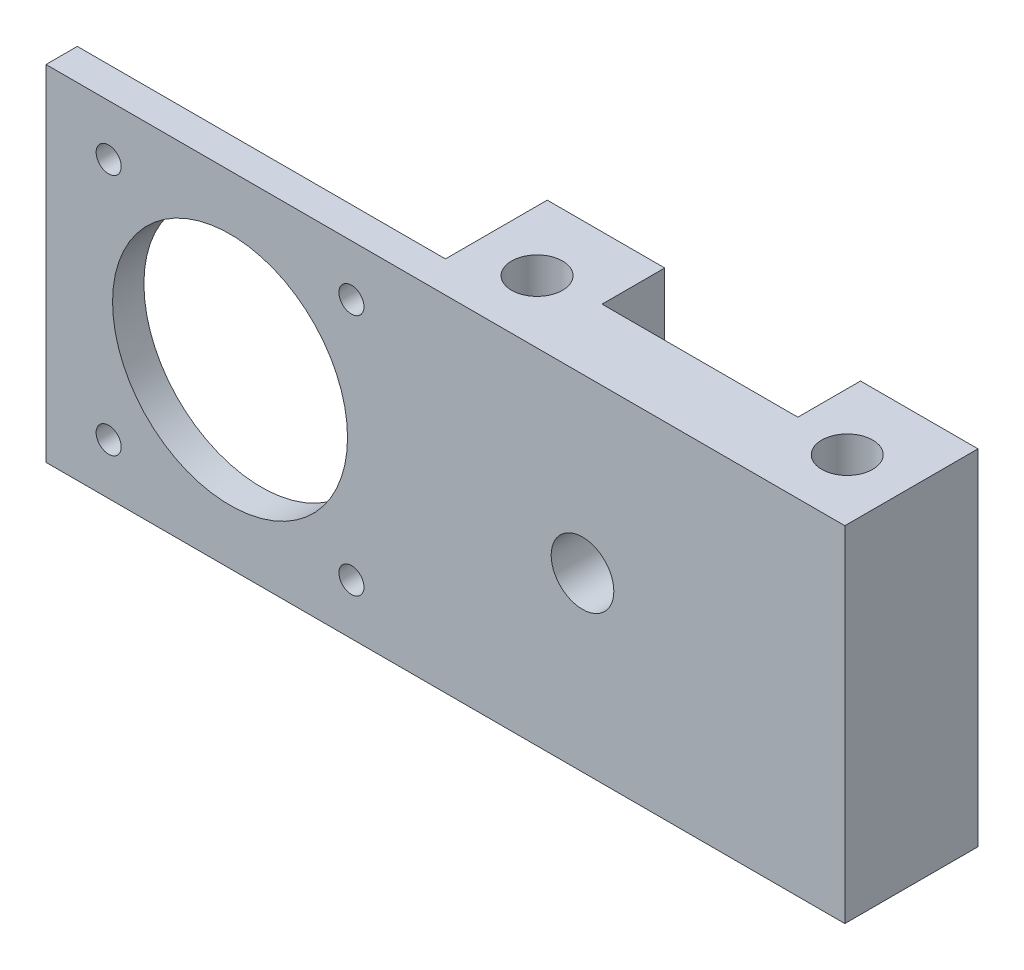
ISO-10303-21;
HEADER;
FILE_DESCRIPTION(('STEP AP214'),'2;1');
FILE_NAME('part.step','',(''),(''),'','','');
FILE_SCHEMA(('AUTOMOTIVE_DESIGN { 1 0 10303 214 1 1 1 1 }'));
ENDSEC;
DATA;
#1=APPLICATION_CONTEXT('core data for automotive mechanical design processes');
#2=APPLICATION_PROTOCOL_DEFINITION('international standard','automotive_design',2000,#1);
#3=PRODUCT_CONTEXT('',#1,'mechanical');
#4=PRODUCT('Part','Part','',(#3));
#5=PRODUCT_RELATED_PRODUCT_CATEGORY('part','',(#4));
#6=PRODUCT_DEFINITION_FORMATION('','',#4);
#7=PRODUCT_DEFINITION_CONTEXT('part definition',#1,'design');
#8=PRODUCT_DEFINITION('design','',#6,#7);
#9=PRODUCT_DEFINITION_SHAPE('','',#8);
#10=(LENGTH_UNIT() NAMED_UNIT(*) SI_UNIT(.MILLI.,.METRE.));
#11=(NAMED_UNIT(*) PLANE_ANGLE_UNIT() SI_UNIT($,.RADIAN.));
#12=(NAMED_UNIT(*) SI_UNIT($,.STERADIAN.) SOLID_ANGLE_UNIT());
#13=UNCERTAINTY_MEASURE_WITH_UNIT(LENGTH_MEASURE(1.E-05),#10,'distance_accuracy_value','');
#14=(GEOMETRIC_REPRESENTATION_CONTEXT(3) GLOBAL_UNCERTAINTY_ASSIGNED_CONTEXT((#13)) GLOBAL_UNIT_ASSIGNED_CONTEXT((#10,
#11,#12)) REPRESENTATION_CONTEXT('',''));
#15=CARTESIAN_POINT('',(0.,0.,0.));
#16=DIRECTION('',(0.,0.,1.));
#17=DIRECTION('',(1.,0.,0.));
#18=AXIS2_PLACEMENT_3D('',#15,#16,#17);
#19=CARTESIAN_POINT('',(0.,0.,0.));
#20=DIRECTION('',(0.,0.,-1.));
#21=DIRECTION('',(-1.,0.,0.));
#22=AXIS2_PLACEMENT_3D('',#19,#20,#21);
#23=PLANE('',#22);
#24=DIRECTION('',(0.,-1.,0.));
#25=VECTOR('',#24,1.);
#26=CARTESIAN_POINT('',(12.5,25.,0.));
#27=LINE('',#26,#25);
#28=CARTESIAN_POINT('',(12.5,22.,0.));
#29=VERTEX_POINT('',#28);
#30=CARTESIAN_POINT('',(12.5,-22.,0.));
#31=VERTEX_POINT('',#30);
#32=EDGE_CURVE('E136',#29,#31,#27,.T.);
#33=ORIENTED_EDGE('',*,*,#32,.F.);
#34=DIRECTION('',(-1.,0.,0.));
#35=VECTOR('',#34,1.);
#36=CARTESIAN_POINT('',(-27.5,22.,0.));
#37=LINE('',#36,#35);
#38=CARTESIAN_POINT('',(27.5,22.,0.));
#39=VERTEX_POINT('',#38);
#40=EDGE_CURVE('E188',#39,#29,#37,.T.);
#41=ORIENTED_EDGE('',*,*,#40,.F.);
#42=DIRECTION('',(0.,1.,0.));
#43=VECTOR('',#42,1.);
#44=CARTESIAN_POINT('',(27.5,-22.,0.));
#45=LINE('',#44,#43);
#46=CARTESIAN_POINT('',(27.5,-22.,0.));
#47=VERTEX_POINT('',#46);
#48=EDGE_CURVE('E184',#47,#39,#45,.T.);
#49=ORIENTED_EDGE('',*,*,#48,.F.);
#50=DIRECTION('',(1.,0.,0.));
#51=VECTOR('',#50,1.);
#52=CARTESIAN_POINT('',(-27.5,-22.,0.));
#53=LINE('',#52,#51);
#54=EDGE_CURVE('E194',#31,#47,#53,.T.);
#55=ORIENTED_EDGE('',*,*,#54,.F.);
#56=EDGE_LOOP('',(#33,#41,#49,#55));
#57=FACE_BOUND('',#56,.T.);
#58=ADVANCED_FACE('F37',(#57),#23,.T.);
#59=CARTESIAN_POINT('',(27.5,-22.,18.));
#60=DIRECTION('',(-1.,0.,0.));
#61=DIRECTION('',(0.,0.,1.));
#62=AXIS2_PLACEMENT_3D('',#59,#60,#61);
#63=PLANE('',#62);
#64=DIRECTION('',(0.,0.,-1.));
#65=VECTOR('',#64,1.);
#66=CARTESIAN_POINT('',(27.5,22.,18.));
#67=LINE('',#66,#65);
#68=CARTESIAN_POINT('',(27.5,22.,17.));
#69=VERTEX_POINT('',#68);
#70=EDGE_CURVE('E11',#69,#39,#67,.T.);
#71=ORIENTED_EDGE('',*,*,#70,.F.);
#72=DIRECTION('',(0.,-1.,0.));
#73=VECTOR('',#72,1.);
#74=CARTESIAN_POINT('',(27.5,-22.,17.));
#75=LINE('',#74,#73);
#76=CARTESIAN_POINT('',(27.5,-22.,17.));
#77=VERTEX_POINT('',#76);
#78=EDGE_CURVE('E234',#69,#77,#75,.T.);
#79=ORIENTED_EDGE('',*,*,#78,.T.);
#80=DIRECTION('',(0.,0.,-1.));
#81=VECTOR('',#80,1.);
#82=CARTESIAN_POINT('',(27.5,-22.,18.));
#83=LINE('',#82,#81);
#84=EDGE_CURVE('E131',#77,#47,#83,.T.);
#85=ORIENTED_EDGE('',*,*,#84,.T.);
#86=ORIENTED_EDGE('',*,*,#48,.T.);
#87=EDGE_LOOP('',(#71,#79,#85,#86));
#88=FACE_BOUND('',#87,.T.);
#89=ADVANCED_FACE('F39',(#88),#63,.F.);
#90=CARTESIAN_POINT('',(-27.5,22.,18.));
#91=DIRECTION('',(0.,-1.,0.));
#92=DIRECTION('',(0.,0.,-1.));
#93=AXIS2_PLACEMENT_3D('',#90,#91,#92);
#94=PLANE('',#93);
#95=DIRECTION('',(0.,0.,1.));
#96=VECTOR('',#95,1.);
#97=CARTESIAN_POINT('',(-74.5,22.,13.));
#98=LINE('',#97,#96);
#99=CARTESIAN_POINT('',(-74.5,22.,13.));
#100=VERTEX_POINT('',#99);
#101=CARTESIAN_POINT('',(-74.5,22.,17.));
#102=VERTEX_POINT('',#101);
#103=EDGE_CURVE('E137',#100,#102,#98,.T.);
#104=ORIENTED_EDGE('',*,*,#103,.T.);
#105=DIRECTION('',(1.,0.,0.));
#106=VECTOR('',#105,1.);
#107=CARTESIAN_POINT('',(-27.5,22.,17.));
#108=LINE('',#107,#106);
#109=EDGE_CURVE('E54',#102,#69,#108,.T.);
#110=ORIENTED_EDGE('',*,*,#109,.T.);
#111=ORIENTED_EDGE('',*,*,#70,.T.);
#112=ORIENTED_EDGE('',*,*,#40,.T.);
#113=DIRECTION('',(0.,0.,1.));
#114=VECTOR('',#113,1.);
#115=CARTESIAN_POINT('',(12.5,22.,18.));
#116=LINE('',#115,#114);
#117=CARTESIAN_POINT('',(12.5,22.,8.));
#118=VERTEX_POINT('',#117);
#119=EDGE_CURVE('E169',#29,#118,#116,.T.);
#120=ORIENTED_EDGE('',*,*,#119,.T.);
#121=DIRECTION('',(-1.,0.,0.));
#122=VECTOR('',#121,1.);
#123=CARTESIAN_POINT('',(-27.5,22.,8.));
#124=LINE('',#123,#122);
#125=CARTESIAN_POINT('',(-12.5,22.,8.));
#126=VERTEX_POINT('',#125);
#127=EDGE_CURVE('E157',#118,#126,#124,.T.);
#128=ORIENTED_EDGE('',*,*,#127,.T.);
#129=DIRECTION('',(0.,0.,-1.));
#130=VECTOR('',#129,1.);
#131=CARTESIAN_POINT('',(-12.5,22.,18.));
#132=LINE('',#131,#130);
#133=CARTESIAN_POINT('',(-12.5,22.,0.));
#134=VERTEX_POINT('',#133);
#135=EDGE_CURVE('E163',#126,#134,#132,.T.);
#136=ORIENTED_EDGE('',*,*,#135,.T.);
#137=CARTESIAN_POINT('',(-27.5,22.,0.));
#138=VERTEX_POINT('',#137);
#139=EDGE_CURVE('E187',#134,#138,#37,.T.);
#140=ORIENTED_EDGE('',*,*,#139,.T.);
#141=DIRECTION('',(0.,0.,-1.));
#142=VECTOR('',#141,1.);
#143=CARTESIAN_POINT('',(-27.5,22.,18.));
#144=LINE('',#143,#142);
#145=CARTESIAN_POINT('',(-27.5,22.,13.));
#146=VERTEX_POINT('',#145);
#147=EDGE_CURVE('E46',#146,#138,#144,.T.);
#148=ORIENTED_EDGE('',*,*,#147,.F.);
#149=DIRECTION('',(-1.,0.,0.));
#150=VECTOR('',#149,1.);
#151=CARTESIAN_POINT('',(-74.5,22.,13.));
#152=LINE('',#151,#150);
#153=EDGE_CURVE('E62',#146,#100,#152,.T.);
#154=ORIENTED_EDGE('',*,*,#153,.T.);
#155=EDGE_LOOP('',(#104,#110,#111,#112,#120,#128,#136,#140,#148,#154));
#156=FACE_BOUND('',#155,.T.);
#157=CARTESIAN_POINT('',(19.8,22.,9.));
#158=DIRECTION('',(0.,1.,0.));
#159=DIRECTION('',(0.,0.,1.));
#160=AXIS2_PLACEMENT_3D('',#157,#158,#159);
#161=CIRCLE('',#160,3.25);
#162=CARTESIAN_POINT('',(19.8,22.,12.25));
#163=VERTEX_POINT('',#162);
#164=EDGE_CURVE('E172',#163,#163,#161,.T.);
#165=ORIENTED_EDGE('',*,*,#164,.F.);
#166=EDGE_LOOP('',(#165));
#167=FACE_BOUND('',#166,.T.);
#168=CARTESIAN_POINT('',(-19.8,22.,9.));
#169=DIRECTION('',(0.,1.,0.));
#170=DIRECTION('',(0.,0.,1.));
#171=AXIS2_PLACEMENT_3D('',#168,#169,#170);
#172=CIRCLE('',#171,3.25);
#173=CARTESIAN_POINT('',(-19.8,22.,12.25));
#174=VERTEX_POINT('',#173);
#175=EDGE_CURVE('E178',#174,#174,#172,.T.);
#176=ORIENTED_EDGE('',*,*,#175,.F.);
#177=EDGE_LOOP('',(#176));
#178=FACE_BOUND('',#177,.T.);
#179=ADVANCED_FACE('F225',(#156,#167,#178),#94,.F.);
#180=CARTESIAN_POINT('',(-27.5,-22.,18.));
#181=DIRECTION('',(1.,0.,0.));
#182=DIRECTION('',(0.,0.,-1.));
#183=AXIS2_PLACEMENT_3D('',#180,#181,#182);
#184=PLANE('',#183);
#185=DIRECTION('',(0.,0.,-1.));
#186=VECTOR('',#185,1.);
#187=CARTESIAN_POINT('',(-27.5,-22.,18.));
#188=LINE('',#187,#186);
#189=CARTESIAN_POINT('',(-27.5,-22.,13.));
#190=VERTEX_POINT('',#189);
#191=CARTESIAN_POINT('',(-27.5,-22.,0.));
#192=VERTEX_POINT('',#191);
#193=EDGE_CURVE('E199',#190,#192,#188,.T.);
#194=ORIENTED_EDGE('',*,*,#193,.F.);
#195=DIRECTION('',(0.,1.,0.));
#196=VECTOR('',#195,1.);
#197=CARTESIAN_POINT('',(-27.5,-22.,13.));
#198=LINE('',#197,#196);
#199=EDGE_CURVE('E256',#190,#146,#198,.T.);
#200=ORIENTED_EDGE('',*,*,#199,.T.);
#201=ORIENTED_EDGE('',*,*,#147,.T.);
#202=DIRECTION('',(0.,-1.,0.));
#203=VECTOR('',#202,1.);
#204=CARTESIAN_POINT('',(-27.5,-22.,0.));
#205=LINE('',#204,#203);
#206=EDGE_CURVE('E191',#138,#192,#205,.T.);
#207=ORIENTED_EDGE('',*,*,#206,.T.);
#208=EDGE_LOOP('',(#194,#200,#201,#207));
#209=FACE_BOUND('',#208,.T.);
#210=ADVANCED_FACE('F260',(#209),#184,.F.);
#211=CARTESIAN_POINT('',(-27.5,-22.,18.));
#212=DIRECTION('',(0.,1.,0.));
#213=DIRECTION('',(0.,0.,1.));
#214=AXIS2_PLACEMENT_3D('',#211,#212,#213);
#215=PLANE('',#214);
#216=CARTESIAN_POINT('',(19.8,-22.,9.));
#217=DIRECTION('',(0.,1.,0.));
#218=DIRECTION('',(0.,0.,1.));
#219=AXIS2_PLACEMENT_3D('',#216,#217,#218);
#220=CIRCLE('',#219,3.24999999999999);
#221=CARTESIAN_POINT('',(19.8,-22.,12.25));
#222=VERTEX_POINT('',#221);
#223=EDGE_CURVE('E175',#222,#222,#220,.T.);
#224=ORIENTED_EDGE('',*,*,#223,.T.);
#225=EDGE_LOOP('',(#224));
#226=FACE_BOUND('',#225,.T.);
#227=CARTESIAN_POINT('',(-19.8,-22.,9.));
#228=DIRECTION('',(0.,1.,0.));
#229=DIRECTION('',(0.,0.,1.));
#230=AXIS2_PLACEMENT_3D('',#227,#228,#229);
#231=CIRCLE('',#230,3.24999999999999);
#232=CARTESIAN_POINT('',(-19.8,-22.,12.25));
#233=VERTEX_POINT('',#232);
#234=EDGE_CURVE('E181',#233,#233,#231,.T.);
#235=ORIENTED_EDGE('',*,*,#234,.T.);
#236=EDGE_LOOP('',(#235));
#237=FACE_BOUND('',#236,.T.);
#238=ORIENTED_EDGE('',*,*,#84,.F.);
#239=DIRECTION('',(-1.,0.,0.));
#240=VECTOR('',#239,1.);
#241=CARTESIAN_POINT('',(-27.5,-22.,17.));
#242=LINE('',#241,#240);
#243=CARTESIAN_POINT('',(-74.5,-22.,17.));
#244=VERTEX_POINT('',#243);
#245=EDGE_CURVE('E117',#77,#244,#242,.T.);
#246=ORIENTED_EDGE('',*,*,#245,.T.);
#247=DIRECTION('',(0.,0.,1.));
#248=VECTOR('',#247,1.);
#249=CARTESIAN_POINT('',(-74.5,-22.,13.));
#250=LINE('',#249,#248);
#251=CARTESIAN_POINT('',(-74.5,-22.,13.));
#252=VERTEX_POINT('',#251);
#253=EDGE_CURVE('E128',#252,#244,#250,.T.);
#254=ORIENTED_EDGE('',*,*,#253,.F.);
#255=DIRECTION('',(1.,0.,0.));
#256=VECTOR('',#255,1.);
#257=CARTESIAN_POINT('',(-74.5,-22.,13.));
#258=LINE('',#257,#256);
#259=EDGE_CURVE('E141',#252,#190,#258,.T.);
#260=ORIENTED_EDGE('',*,*,#259,.T.);
#261=ORIENTED_EDGE('',*,*,#193,.T.);
#262=CARTESIAN_POINT('',(-12.5,-22.,0.));
#263=VERTEX_POINT('',#262);
#264=EDGE_CURVE('E195',#192,#263,#53,.T.);
#265=ORIENTED_EDGE('',*,*,#264,.T.);
#266=DIRECTION('',(0.,0.,1.));
#267=VECTOR('',#266,1.);
#268=CARTESIAN_POINT('',(-12.5,-22.,18.));
#269=LINE('',#268,#267);
#270=CARTESIAN_POINT('',(-12.5,-22.,8.));
#271=VERTEX_POINT('',#270);
#272=EDGE_CURVE('E160',#263,#271,#269,.T.);
#273=ORIENTED_EDGE('',*,*,#272,.T.);
#274=DIRECTION('',(1.,0.,0.));
#275=VECTOR('',#274,1.);
#276=CARTESIAN_POINT('',(-27.5,-22.,8.));
#277=LINE('',#276,#275);
#278=CARTESIAN_POINT('',(12.5,-22.,8.));
#279=VERTEX_POINT('',#278);
#280=EDGE_CURVE('E154',#271,#279,#277,.T.);
#281=ORIENTED_EDGE('',*,*,#280,.T.);
#282=DIRECTION('',(0.,0.,-1.));
#283=VECTOR('',#282,1.);
#284=CARTESIAN_POINT('',(12.5,-22.,18.));
#285=LINE('',#284,#283);
#286=EDGE_CURVE('E166',#279,#31,#285,.T.);
#287=ORIENTED_EDGE('',*,*,#286,.T.);
#288=ORIENTED_EDGE('',*,*,#54,.T.);
#289=EDGE_LOOP('',(#238,#246,#254,#260,#261,#265,#273,#281,#287,#288));
#290=FACE_BOUND('',#289,.T.);
#291=ADVANCED_FACE('F126',(#226,#237,#290),#215,.F.);
#292=DIRECTION('',(0.,1.,0.));
#293=VECTOR('',#292,1.);
#294=CARTESIAN_POINT('',(-12.5,25.,0.));
#295=LINE('',#294,#293);
#296=EDGE_CURVE('E139',#263,#134,#295,.T.);
#297=ORIENTED_EDGE('',*,*,#296,.F.);
#298=ORIENTED_EDGE('',*,*,#264,.F.);
#299=ORIENTED_EDGE('',*,*,#206,.F.);
#300=ORIENTED_EDGE('',*,*,#139,.F.);
#301=EDGE_LOOP('',(#297,#298,#299,#300));
#302=FACE_BOUND('',#301,.T.);
#303=ADVANCED_FACE('F220',(#302),#23,.T.);
#304=CARTESIAN_POINT('',(-6.,0.,0.));
#305=DIRECTION('',(0.,0.,1.));
#306=DIRECTION('',(1.,0.,0.));
#307=AXIS2_PLACEMENT_3D('',#304,#305,#306);
#308=CYLINDRICAL_SURFACE('',#307,4.);
#309=CARTESIAN_POINT('',(-6.,0.,17.));
#310=DIRECTION('',(0.,0.,-1.));
#311=DIRECTION('',(-1.,0.,0.));
#312=AXIS2_PLACEMENT_3D('',#309,#310,#311);
#313=CIRCLE('',#312,4.);
#314=CARTESIAN_POINT('',(-10.,0.,17.));
#315=VERTEX_POINT('',#314);
#316=EDGE_CURVE('E235',#315,#315,#313,.F.);
#317=ORIENTED_EDGE('',*,*,#316,.T.);
#318=EDGE_LOOP('',(#317));
#319=FACE_BOUND('',#318,.T.);
#320=CARTESIAN_POINT('',(-6.,0.,8.));
#321=DIRECTION('',(0.,0.,1.));
#322=DIRECTION('',(1.,0.,0.));
#323=AXIS2_PLACEMENT_3D('',#320,#321,#322);
#324=CIRCLE('',#323,4.);
#325=CARTESIAN_POINT('',(-2.,0.,8.));
#326=VERTEX_POINT('',#325);
#327=EDGE_CURVE('E151',#326,#326,#324,.F.);
#328=ORIENTED_EDGE('',*,*,#327,.T.);
#329=EDGE_LOOP('',(#328));
#330=FACE_BOUND('',#329,.T.);
#331=ADVANCED_FACE('F204',(#319,#330),#308,.F.);
#332=CARTESIAN_POINT('',(-19.8,22.,9.));
#333=DIRECTION('',(0.,1.,0.));
#334=DIRECTION('',(0.,0.,1.));
#335=AXIS2_PLACEMENT_3D('',#332,#333,#334);
#336=CYLINDRICAL_SURFACE('',#335,3.25);
#337=ORIENTED_EDGE('',*,*,#234,.F.);
#338=EDGE_LOOP('',(#337));
#339=FACE_BOUND('',#338,.T.);
#340=ORIENTED_EDGE('',*,*,#175,.T.);
#341=EDGE_LOOP('',(#340));
#342=FACE_BOUND('',#341,.T.);
#343=ADVANCED_FACE('F292',(#339,#342),#336,.F.);
#344=CARTESIAN_POINT('',(19.8,22.,9.));
#345=DIRECTION('',(0.,1.,0.));
#346=DIRECTION('',(0.,0.,1.));
#347=AXIS2_PLACEMENT_3D('',#344,#345,#346);
#348=CYLINDRICAL_SURFACE('',#347,3.25);
#349=ORIENTED_EDGE('',*,*,#223,.F.);
#350=EDGE_LOOP('',(#349));
#351=FACE_BOUND('',#350,.T.);
#352=ORIENTED_EDGE('',*,*,#164,.T.);
#353=EDGE_LOOP('',(#352));
#354=FACE_BOUND('',#353,.T.);
#355=ADVANCED_FACE('F340',(#351,#354),#348,.F.);
#356=CARTESIAN_POINT('',(12.5,25.,8.));
#357=DIRECTION('',(1.,0.,0.));
#358=DIRECTION('',(0.,1.,0.));
#359=AXIS2_PLACEMENT_3D('',#356,#357,#358);
#360=PLANE('',#359);
#361=ORIENTED_EDGE('',*,*,#32,.T.);
#362=ORIENTED_EDGE('',*,*,#286,.F.);
#363=DIRECTION('',(0.,-1.,0.));
#364=VECTOR('',#363,1.);
#365=CARTESIAN_POINT('',(12.5,25.,8.));
#366=LINE('',#365,#364);
#367=EDGE_CURVE('E146',#118,#279,#366,.T.);
#368=ORIENTED_EDGE('',*,*,#367,.F.);
#369=ORIENTED_EDGE('',*,*,#119,.F.);
#370=EDGE_LOOP('',(#361,#362,#368,#369));
#371=FACE_BOUND('',#370,.T.);
#372=ADVANCED_FACE('F229',(#371),#360,.F.);
#373=CARTESIAN_POINT('',(-12.5,25.,8.));
#374=DIRECTION('',(-1.,0.,0.));
#375=DIRECTION('',(0.,-1.,0.));
#376=AXIS2_PLACEMENT_3D('',#373,#374,#375);
#377=PLANE('',#376);
#378=DIRECTION('',(0.,1.,0.));
#379=VECTOR('',#378,1.);
#380=CARTESIAN_POINT('',(-12.5,25.,8.));
#381=LINE('',#380,#379);
#382=EDGE_CURVE('E149',#271,#126,#381,.T.);
#383=ORIENTED_EDGE('',*,*,#382,.F.);
#384=ORIENTED_EDGE('',*,*,#272,.F.);
#385=ORIENTED_EDGE('',*,*,#296,.T.);
#386=ORIENTED_EDGE('',*,*,#135,.F.);
#387=EDGE_LOOP('',(#383,#384,#385,#386));
#388=FACE_BOUND('',#387,.T.);
#389=ADVANCED_FACE('F209',(#388),#377,.F.);
#390=CARTESIAN_POINT('',(0.,0.,8.));
#391=DIRECTION('',(0.,0.,1.));
#392=DIRECTION('',(1.,0.,0.));
#393=AXIS2_PLACEMENT_3D('',#390,#391,#392);
#394=PLANE('',#393);
#395=ORIENTED_EDGE('',*,*,#327,.F.);
#396=EDGE_LOOP('',(#395));
#397=FACE_BOUND('',#396,.T.);
#398=ORIENTED_EDGE('',*,*,#367,.T.);
#399=ORIENTED_EDGE('',*,*,#280,.F.);
#400=ORIENTED_EDGE('',*,*,#382,.T.);
#401=ORIENTED_EDGE('',*,*,#127,.F.);
#402=EDGE_LOOP('',(#398,#399,#400,#401));
#403=FACE_BOUND('',#402,.T.);
#404=ADVANCED_FACE('F206',(#397,#403),#394,.F.);
#405=CARTESIAN_POINT('',(-74.5,-22.,13.));
#406=DIRECTION('',(-1.,0.,0.));
#407=DIRECTION('',(0.,0.,1.));
#408=AXIS2_PLACEMENT_3D('',#405,#406,#407);
#409=PLANE('',#408);
#410=DIRECTION('',(0.,-1.,0.));
#411=VECTOR('',#410,1.);
#412=CARTESIAN_POINT('',(-74.5,-22.,17.));
#413=LINE('',#412,#411);
#414=EDGE_CURVE('E113',#102,#244,#413,.T.);
#415=ORIENTED_EDGE('',*,*,#414,.F.);
#416=ORIENTED_EDGE('',*,*,#103,.F.);
#417=DIRECTION('',(0.,-1.,0.));
#418=VECTOR('',#417,1.);
#419=CARTESIAN_POINT('',(-74.5,-22.,13.));
#420=LINE('',#419,#418);
#421=EDGE_CURVE('E134',#100,#252,#420,.T.);
#422=ORIENTED_EDGE('',*,*,#421,.T.);
#423=ORIENTED_EDGE('',*,*,#253,.T.);
#424=EDGE_LOOP('',(#415,#416,#422,#423));
#425=FACE_BOUND('',#424,.T.);
#426=ADVANCED_FACE('F133',(#425),#409,.T.);
#427=CARTESIAN_POINT('',(0.,0.,13.));
#428=DIRECTION('',(0.,0.,-1.));
#429=DIRECTION('',(-1.,0.,0.));
#430=AXIS2_PLACEMENT_3D('',#427,#428,#429);
#431=PLANE('',#430);
#432=CARTESIAN_POINT('',(-66.4999999999998,-15.5000000000002,13.));
#433=DIRECTION('',(0.,0.,-1.));
#434=DIRECTION('',(-1.,0.,0.));
#435=AXIS2_PLACEMENT_3D('',#432,#433,#434);
#436=CIRCLE('',#435,1.59999999999999);
#437=CARTESIAN_POINT('',(-68.0999999999998,-15.5000000000002,13.));
#438=VERTEX_POINT('',#437);
#439=EDGE_CURVE('E238',#438,#438,#436,.T.);
#440=ORIENTED_EDGE('',*,*,#439,.F.);
#441=EDGE_LOOP('',(#440));
#442=FACE_BOUND('',#441,.T.);
#443=CARTESIAN_POINT('',(-66.5,15.5,13.));
#444=DIRECTION('',(0.,0.,-1.));
#445=DIRECTION('',(-1.,0.,0.));
#446=AXIS2_PLACEMENT_3D('',#443,#444,#445);
#447=CIRCLE('',#446,1.59999999999999);
#448=CARTESIAN_POINT('',(-68.1,15.5,13.));
#449=VERTEX_POINT('',#448);
#450=EDGE_CURVE('E244',#449,#449,#447,.T.);
#451=ORIENTED_EDGE('',*,*,#450,.F.);
#452=EDGE_LOOP('',(#451));
#453=FACE_BOUND('',#452,.T.);
#454=CARTESIAN_POINT('',(-35.5,15.5000000000001,13.));
#455=DIRECTION('',(0.,0.,-1.));
#456=DIRECTION('',(-1.,0.,0.));
#457=AXIS2_PLACEMENT_3D('',#454,#455,#456);
#458=CIRCLE('',#457,1.6);
#459=CARTESIAN_POINT('',(-37.1000000000001,15.5000000000001,13.));
#460=VERTEX_POINT('',#459);
#461=EDGE_CURVE('E247',#460,#460,#458,.T.);
#462=ORIENTED_EDGE('',*,*,#461,.F.);
#463=EDGE_LOOP('',(#462));
#464=FACE_BOUND('',#463,.T.);
#465=CARTESIAN_POINT('',(-35.5,-15.5,13.));
#466=DIRECTION('',(0.,0.,-1.));
#467=DIRECTION('',(-1.,0.,0.));
#468=AXIS2_PLACEMENT_3D('',#465,#466,#467);
#469=CIRCLE('',#468,1.6);
#470=CARTESIAN_POINT('',(-37.1,-15.5,13.));
#471=VERTEX_POINT('',#470);
#472=EDGE_CURVE('E250',#471,#471,#469,.T.);
#473=ORIENTED_EDGE('',*,*,#472,.F.);
#474=EDGE_LOOP('',(#473));
#475=FACE_BOUND('',#474,.T.);
#476=CARTESIAN_POINT('',(-51.,0.,13.));
#477=DIRECTION('',(0.,0.,1.));
#478=DIRECTION('',(1.,0.,0.));
#479=AXIS2_PLACEMENT_3D('',#476,#477,#478);
#480=CIRCLE('',#479,15.);
#481=CARTESIAN_POINT('',(-36.,0.,13.));
#482=VERTEX_POINT('',#481);
#483=EDGE_CURVE('E253',#482,#482,#480,.T.);
#484=ORIENTED_EDGE('',*,*,#483,.T.);
#485=EDGE_LOOP('',(#484));
#486=FACE_BOUND('',#485,.T.);
#487=ORIENTED_EDGE('',*,*,#199,.F.);
#488=ORIENTED_EDGE('',*,*,#259,.F.);
#489=ORIENTED_EDGE('',*,*,#421,.F.);
#490=ORIENTED_EDGE('',*,*,#153,.F.);
#491=EDGE_LOOP('',(#487,#488,#489,#490));
#492=FACE_BOUND('',#491,.T.);
#493=ADVANCED_FACE('F261',(#442,#453,#464,#475,#486,#492),#431,.T.);
#494=CARTESIAN_POINT('',(-51.,0.,13.));
#495=DIRECTION('',(0.,0.,1.));
#496=DIRECTION('',(1.,0.,0.));
#497=AXIS2_PLACEMENT_3D('',#494,#495,#496);
#498=CYLINDRICAL_SURFACE('',#497,15.);
#499=CARTESIAN_POINT('',(-51.,0.,17.));
#500=DIRECTION('',(0.,0.,-1.));
#501=DIRECTION('',(-1.,0.,0.));
#502=AXIS2_PLACEMENT_3D('',#499,#500,#501);
#503=CIRCLE('',#502,15.);
#504=CARTESIAN_POINT('',(-66.,0.,17.));
#505=VERTEX_POINT('',#504);
#506=EDGE_CURVE('E122',#505,#505,#503,.F.);
#507=ORIENTED_EDGE('',*,*,#506,.T.);
#508=EDGE_LOOP('',(#507));
#509=FACE_BOUND('',#508,.T.);
#510=ORIENTED_EDGE('',*,*,#483,.F.);
#511=EDGE_LOOP('',(#510));
#512=FACE_BOUND('',#511,.T.);
#513=ADVANCED_FACE('F263',(#509,#512),#498,.F.);
#514=CARTESIAN_POINT('',(-35.5,-15.5,13.));
#515=DIRECTION('',(0.,0.,-1.));
#516=DIRECTION('',(-1.,0.,0.));
#517=AXIS2_PLACEMENT_3D('',#514,#515,#516);
#518=CYLINDRICAL_SURFACE('',#517,1.6);
#519=CARTESIAN_POINT('',(-35.5,-15.5,17.));
#520=DIRECTION('',(0.,0.,-1.));
#521=DIRECTION('',(-1.,0.,0.));
#522=AXIS2_PLACEMENT_3D('',#519,#520,#521);
#523=CIRCLE('',#522,1.6);
#524=CARTESIAN_POINT('',(-37.1,-15.5,17.));
#525=VERTEX_POINT('',#524);
#526=EDGE_CURVE('E439',#525,#525,#523,.F.);
#527=ORIENTED_EDGE('',*,*,#526,.T.);
#528=EDGE_LOOP('',(#527));
#529=FACE_BOUND('',#528,.T.);
#530=ORIENTED_EDGE('',*,*,#472,.T.);
#531=EDGE_LOOP('',(#530));
#532=FACE_BOUND('',#531,.T.);
#533=ADVANCED_FACE('F271',(#529,#532),#518,.F.);
#534=CARTESIAN_POINT('',(-35.5,15.5000000000001,13.));
#535=DIRECTION('',(0.,0.,-1.));
#536=DIRECTION('',(-1.,0.,0.));
#537=AXIS2_PLACEMENT_3D('',#534,#535,#536);
#538=CYLINDRICAL_SURFACE('',#537,1.6);
#539=CARTESIAN_POINT('',(-35.5,15.5000000000001,17.));
#540=DIRECTION('',(0.,0.,-1.));
#541=DIRECTION('',(-1.,0.,0.));
#542=AXIS2_PLACEMENT_3D('',#539,#540,#541);
#543=CIRCLE('',#542,1.6);
#544=CARTESIAN_POINT('',(-37.1000000000001,15.5000000000001,17.));
#545=VERTEX_POINT('',#544);
#546=EDGE_CURVE('E435',#545,#545,#543,.F.);
#547=ORIENTED_EDGE('',*,*,#546,.T.);
#548=EDGE_LOOP('',(#547));
#549=FACE_BOUND('',#548,.T.);
#550=ORIENTED_EDGE('',*,*,#461,.T.);
#551=EDGE_LOOP('',(#550));
#552=FACE_BOUND('',#551,.T.);
#553=ADVANCED_FACE('F384',(#549,#552),#538,.F.);
#554=CARTESIAN_POINT('',(-66.5,15.5,13.));
#555=DIRECTION('',(0.,0.,-1.));
#556=DIRECTION('',(-1.,0.,0.));
#557=AXIS2_PLACEMENT_3D('',#554,#555,#556);
#558=CYLINDRICAL_SURFACE('',#557,1.59999999999999);
#559=CARTESIAN_POINT('',(-66.5,15.5,17.));
#560=DIRECTION('',(0.,0.,-1.));
#561=DIRECTION('',(-1.,0.,0.));
#562=AXIS2_PLACEMENT_3D('',#559,#560,#561);
#563=CIRCLE('',#562,1.59999999999999);
#564=CARTESIAN_POINT('',(-68.1,15.5,17.));
#565=VERTEX_POINT('',#564);
#566=EDGE_CURVE('E433',#565,#565,#563,.F.);
#567=ORIENTED_EDGE('',*,*,#566,.T.);
#568=EDGE_LOOP('',(#567));
#569=FACE_BOUND('',#568,.T.);
#570=ORIENTED_EDGE('',*,*,#450,.T.);
#571=EDGE_LOOP('',(#570));
#572=FACE_BOUND('',#571,.T.);
#573=ADVANCED_FACE('F392',(#569,#572),#558,.F.);
#574=CARTESIAN_POINT('',(-66.4999999999998,-15.5000000000002,13.));
#575=DIRECTION('',(0.,0.,-1.));
#576=DIRECTION('',(-1.,0.,0.));
#577=AXIS2_PLACEMENT_3D('',#574,#575,#576);
#578=CYLINDRICAL_SURFACE('',#577,1.59999999999999);
#579=CARTESIAN_POINT('',(-66.4999999999998,-15.5000000000002,17.));
#580=DIRECTION('',(0.,0.,-1.));
#581=DIRECTION('',(-1.,0.,0.));
#582=AXIS2_PLACEMENT_3D('',#579,#580,#581);
#583=CIRCLE('',#582,1.59999999999999);
#584=CARTESIAN_POINT('',(-68.0999999999998,-15.5000000000002,17.));
#585=VERTEX_POINT('',#584);
#586=EDGE_CURVE('E41',#585,#585,#583,.F.);
#587=ORIENTED_EDGE('',*,*,#586,.T.);
#588=EDGE_LOOP('',(#587));
#589=FACE_BOUND('',#588,.T.);
#590=ORIENTED_EDGE('',*,*,#439,.T.);
#591=EDGE_LOOP('',(#590));
#592=FACE_BOUND('',#591,.T.);
#593=ADVANCED_FACE('F400',(#589,#592),#578,.F.);
#594=CARTESIAN_POINT('',(0.,0.,17.));
#595=DIRECTION('',(0.,0.,-1.));
#596=DIRECTION('',(-1.,0.,0.));
#597=AXIS2_PLACEMENT_3D('',#594,#595,#596);
#598=PLANE('',#597);
#599=ORIENTED_EDGE('',*,*,#109,.F.);
#600=ORIENTED_EDGE('',*,*,#414,.T.);
#601=ORIENTED_EDGE('',*,*,#245,.F.);
#602=ORIENTED_EDGE('',*,*,#78,.F.);
#603=EDGE_LOOP('',(#599,#600,#601,#602));
#604=FACE_BOUND('',#603,.T.);
#605=ORIENTED_EDGE('',*,*,#526,.F.);
#606=EDGE_LOOP('',(#605));
#607=FACE_BOUND('',#606,.T.);
#608=ORIENTED_EDGE('',*,*,#566,.F.);
#609=EDGE_LOOP('',(#608));
#610=FACE_BOUND('',#609,.T.);
#611=ORIENTED_EDGE('',*,*,#586,.F.);
#612=EDGE_LOOP('',(#611));
#613=FACE_BOUND('',#612,.T.);
#614=ORIENTED_EDGE('',*,*,#546,.F.);
#615=EDGE_LOOP('',(#614));
#616=FACE_BOUND('',#615,.T.);
#617=ORIENTED_EDGE('',*,*,#506,.F.);
#618=EDGE_LOOP('',(#617));
#619=FACE_BOUND('',#618,.T.);
#620=ORIENTED_EDGE('',*,*,#316,.F.);
#621=EDGE_LOOP('',(#620));
#622=FACE_BOUND('',#621,.T.);
#623=ADVANCED_FACE('F115',(#604,#607,#610,#613,#616,#619,#622),#598,.F.);
#624=CLOSED_SHELL('',(#58,#89,#179,#210,#291,#303,#331,#343,#355,#372,#389,#404,#426,#493,#513,
#533,#553,#573,#593,#623));
#625=MANIFOLD_SOLID_BREP('B2',#624);
#626=ADVANCED_BREP_SHAPE_REPRESENTATION('',(#18,#625),#14);
#627=SHAPE_DEFINITION_REPRESENTATION(#9,#626);
ENDSEC;
END-ISO-10303-21;
